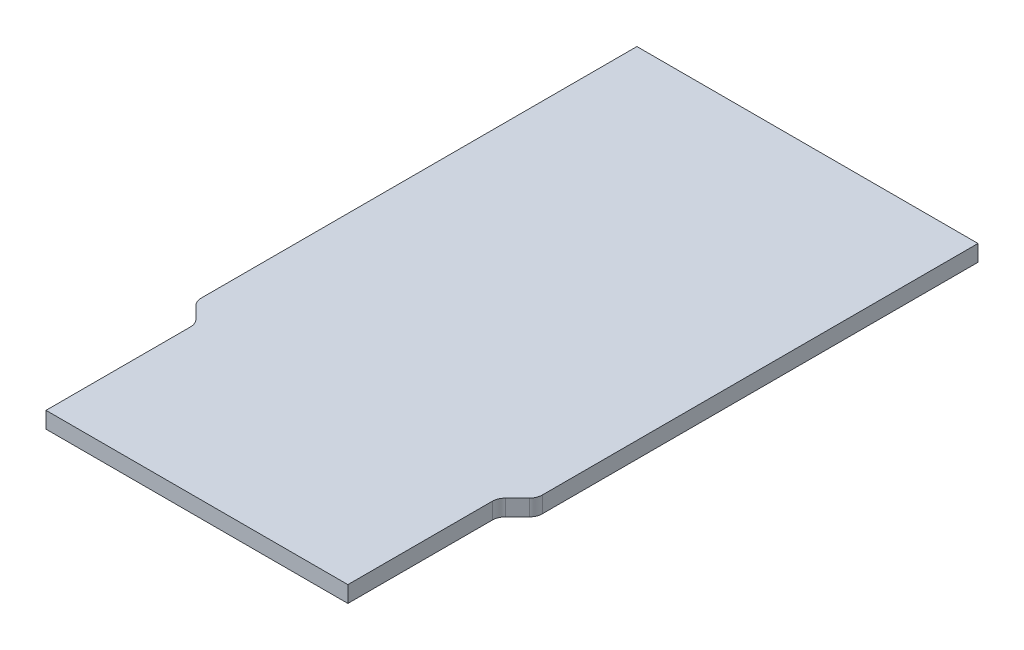
ISO-10303-21;
HEADER;
FILE_DESCRIPTION(('STEP AP214'),'2;1');
FILE_NAME('part.step','',(''),(''),'','','');
FILE_SCHEMA(('AUTOMOTIVE_DESIGN { 1 0 10303 214 1 1 1 1 }'));
ENDSEC;
DATA;
#1=APPLICATION_CONTEXT('core data for automotive mechanical design processes');
#2=APPLICATION_PROTOCOL_DEFINITION('international standard','automotive_design',2000,#1);
#3=PRODUCT_CONTEXT('',#1,'mechanical');
#4=PRODUCT('Part','Part','',(#3));
#5=PRODUCT_RELATED_PRODUCT_CATEGORY('part','',(#4));
#6=PRODUCT_DEFINITION_FORMATION('','',#4);
#7=PRODUCT_DEFINITION_CONTEXT('part definition',#1,'design');
#8=PRODUCT_DEFINITION('design','',#6,#7);
#9=PRODUCT_DEFINITION_SHAPE('','',#8);
#10=(LENGTH_UNIT() NAMED_UNIT(*) SI_UNIT(.MILLI.,.METRE.));
#11=(NAMED_UNIT(*) PLANE_ANGLE_UNIT() SI_UNIT($,.RADIAN.));
#12=(NAMED_UNIT(*) SI_UNIT($,.STERADIAN.) SOLID_ANGLE_UNIT());
#13=UNCERTAINTY_MEASURE_WITH_UNIT(LENGTH_MEASURE(1.E-05),#10,'distance_accuracy_value','');
#14=(GEOMETRIC_REPRESENTATION_CONTEXT(3) GLOBAL_UNCERTAINTY_ASSIGNED_CONTEXT((#13)) GLOBAL_UNIT_ASSIGNED_CONTEXT((#10,
#11,#12)) REPRESENTATION_CONTEXT('',''));
#15=CARTESIAN_POINT('',(0.,0.,0.));
#16=DIRECTION('',(0.,0.,1.));
#17=DIRECTION('',(1.,0.,0.));
#18=AXIS2_PLACEMENT_3D('',#15,#16,#17);
#19=CARTESIAN_POINT('',(-13.3427521616477,7.36119552615719,48.2385191324047));
#20=DIRECTION('',(0.,0.,1.));
#21=DIRECTION('',(1.,0.,0.));
#22=AXIS2_PLACEMENT_3D('',#19,#20,#21);
#23=PLANE('',#22);
#24=DIRECTION('',(1.,0.,0.));
#25=VECTOR('',#24,1.);
#26=CARTESIAN_POINT('',(-13.3427521616477,7.36119552615719,48.2385191324047));
#27=LINE('',#26,#25);
#28=CARTESIAN_POINT('',(-34.9427521616477,7.36119552615719,48.2385191324047));
#29=VERTEX_POINT('',#28);
#30=CARTESIAN_POINT('',(11.2572478383523,7.36119552615719,48.2385191324047));
#31=VERTEX_POINT('',#30);
#32=EDGE_CURVE('E208',#29,#31,#27,.T.);
#33=ORIENTED_EDGE('',*,*,#32,.T.);
#34=DIRECTION('',(0.,-1.,0.));
#35=VECTOR('',#34,1.);
#36=CARTESIAN_POINT('',(11.2572478383523,106.874534692367,48.2385191324047));
#37=LINE('',#36,#35);
#38=CARTESIAN_POINT('',(11.2572478383523,9.86119552615719,48.2385191324047));
#39=VERTEX_POINT('',#38);
#40=EDGE_CURVE('E143',#39,#31,#37,.T.);
#41=ORIENTED_EDGE('',*,*,#40,.F.);
#42=DIRECTION('',(1.,0.,0.));
#43=VECTOR('',#42,1.);
#44=CARTESIAN_POINT('',(-37.9427521616477,9.86119552615719,48.2385191324047));
#45=LINE('',#44,#43);
#46=CARTESIAN_POINT('',(-34.9427521616477,9.86119552615719,48.2385191324047));
#47=VERTEX_POINT('',#46);
#48=EDGE_CURVE('E52',#39,#47,#45,.F.);
#49=ORIENTED_EDGE('',*,*,#48,.T.);
#50=DIRECTION('',(0.,1.,0.));
#51=VECTOR('',#50,1.);
#52=CARTESIAN_POINT('',(-34.9427521616477,7.36119552615719,48.2385191324047));
#53=LINE('',#52,#51);
#54=EDGE_CURVE('E78',#29,#47,#53,.T.);
#55=ORIENTED_EDGE('',*,*,#54,.F.);
#56=EDGE_LOOP('',(#33,#41,#49,#55));
#57=FACE_BOUND('',#56,.T.);
#58=ADVANCED_FACE('F35',(#57),#23,.T.);
#59=CARTESIAN_POINT('',(-13.3427521616477,7.36119552615719,15.802027459301));
#60=DIRECTION('',(0.,1.,0.));
#61=DIRECTION('',(0.,0.,1.));
#62=AXIS2_PLACEMENT_3D('',#59,#60,#61);
#63=PLANE('',#62);
#64=DIRECTION('',(0.,0.,1.));
#65=VECTOR('',#64,1.);
#66=CARTESIAN_POINT('',(-37.9427521616477,7.36119552615719,15.802027459301));
#67=LINE('',#66,#65);
#68=CARTESIAN_POINT('',(-37.9427521616477,7.36119552615719,-45.197972540699));
#69=VERTEX_POINT('',#68);
#70=CARTESIAN_POINT('',(-37.9427521616477,7.36119552615719,21.473600334555));
#71=VERTEX_POINT('',#70);
#72=EDGE_CURVE('E194',#69,#71,#67,.T.);
#73=ORIENTED_EDGE('',*,*,#72,.F.);
#74=DIRECTION('',(-1.,0.,0.));
#75=VECTOR('',#74,1.);
#76=CARTESIAN_POINT('',(-13.3427521616477,7.36119552615719,-45.197972540699));
#77=LINE('',#76,#75);
#78=CARTESIAN_POINT('',(14.2572478383523,7.36119552615719,-45.197972540699));
#79=VERTEX_POINT('',#78);
#80=EDGE_CURVE('E169',#79,#69,#77,.T.);
#81=ORIENTED_EDGE('',*,*,#80,.F.);
#82=DIRECTION('',(0.,0.,1.));
#83=VECTOR('',#82,1.);
#84=CARTESIAN_POINT('',(14.2572478383523,7.36119552615719,-43.1979725406991));
#85=LINE('',#84,#83);
#86=CARTESIAN_POINT('',(14.2572478383523,7.36119552615719,21.473600334555));
#87=VERTEX_POINT('',#86);
#88=EDGE_CURVE('E158',#79,#87,#85,.T.);
#89=ORIENTED_EDGE('',*,*,#88,.T.);
#90=CARTESIAN_POINT('',(12.2572478383523,7.36119552615719,21.473600334555));
#91=DIRECTION('',(0.,-1.,0.));
#92=DIRECTION('',(1.,0.,0.));
#93=AXIS2_PLACEMENT_3D('',#90,#91,#92);
#94=CIRCLE('',#93,1.99999999999944);
#95=CARTESIAN_POINT('',(13.6714614007235,7.36119552615719,22.8878138969291));
#96=VERTEX_POINT('',#95);
#97=EDGE_CURVE('E171',#87,#96,#94,.T.);
#98=ORIENTED_EDGE('',*,*,#97,.T.);
#99=DIRECTION('',(-0.707106781185696,0.,0.707106781187399));
#100=VECTOR('',#99,1.);
#101=CARTESIAN_POINT('',(13.6714614007231,7.36119552615719,22.8878138969288));
#102=LINE('',#101,#100);
#103=CARTESIAN_POINT('',(11.8430342759823,7.36119552615719,24.716241021674));
#104=VERTEX_POINT('',#103);
#105=EDGE_CURVE('E174',#96,#104,#102,.T.);
#106=ORIENTED_EDGE('',*,*,#105,.T.);
#107=CARTESIAN_POINT('',(13.2572478383523,7.36119552615719,26.130454584051));
#108=DIRECTION('',(0.,1.,0.));
#109=DIRECTION('',(1.,0.,0.));
#110=AXIS2_PLACEMENT_3D('',#107,#108,#109);
#111=CIRCLE('',#110,2.00000000000043);
#112=CARTESIAN_POINT('',(11.2572478383519,7.36119552615719,26.130454584051));
#113=VERTEX_POINT('',#112);
#114=EDGE_CURVE('E177',#104,#113,#111,.T.);
#115=ORIENTED_EDGE('',*,*,#114,.T.);
#116=DIRECTION('',(0.,0.,1.));
#117=VECTOR('',#116,1.);
#118=CARTESIAN_POINT('',(11.257247838352,7.36119552615719,26.130454584051));
#119=LINE('',#118,#117);
#120=EDGE_CURVE('E180',#113,#31,#119,.T.);
#121=ORIENTED_EDGE('',*,*,#120,.T.);
#122=ORIENTED_EDGE('',*,*,#32,.F.);
#123=DIRECTION('',(0.,0.,1.));
#124=VECTOR('',#123,1.);
#125=CARTESIAN_POINT('',(-34.9427521616473,7.36119552615719,15.8020274593007));
#126=LINE('',#125,#124);
#127=CARTESIAN_POINT('',(-34.9427521616474,7.36119552615719,26.130454584051));
#128=VERTEX_POINT('',#127);
#129=EDGE_CURVE('E206',#128,#29,#126,.T.);
#130=ORIENTED_EDGE('',*,*,#129,.F.);
#131=CARTESIAN_POINT('',(-36.9427521616477,7.36119552615719,26.130454584051));
#132=DIRECTION('',(0.,1.,0.));
#133=DIRECTION('',(0.,0.,1.));
#134=AXIS2_PLACEMENT_3D('',#131,#132,#133);
#135=CIRCLE('',#134,2.00000000000043);
#136=CARTESIAN_POINT('',(-35.5285385992777,7.36119552615719,24.716241021674));
#137=VERTEX_POINT('',#136);
#138=EDGE_CURVE('E203',#128,#137,#135,.T.);
#139=ORIENTED_EDGE('',*,*,#138,.T.);
#140=DIRECTION('',(0.707106781185696,0.,0.707106781187399));
#141=VECTOR('',#140,1.);
#142=CARTESIAN_POINT('',(-28.8927521616759,7.36119552615719,31.3520274592917));
#143=LINE('',#142,#141);
#144=CARTESIAN_POINT('',(-37.3569657240185,7.36119552615719,22.8878138969288));
#145=VERTEX_POINT('',#144);
#146=EDGE_CURVE('E200',#145,#137,#143,.T.);
#147=ORIENTED_EDGE('',*,*,#146,.F.);
#148=CARTESIAN_POINT('',(-35.9427521616477,7.36119552615719,21.473600334555));
#149=DIRECTION('',(0.,1.,0.));
#150=DIRECTION('',(0.,0.,1.));
#151=AXIS2_PLACEMENT_3D('',#148,#149,#150);
#152=CIRCLE('',#151,1.99999999999943);
#153=EDGE_CURVE('E197',#71,#145,#152,.T.);
#154=ORIENTED_EDGE('',*,*,#153,.F.);
#155=EDGE_LOOP('',(#73,#81,#89,#98,#106,#115,#121,#122,#130,#139,#147,#154));
#156=FACE_BOUND('',#155,.T.);
#157=ADVANCED_FACE('F229',(#156),#63,.F.);
#158=CARTESIAN_POINT('',(-34.9427521616477,43.7450790026372,47.185910935781));
#159=DIRECTION('',(1.,0.,0.));
#160=DIRECTION('',(0.,0.,-1.));
#161=AXIS2_PLACEMENT_3D('',#158,#159,#160);
#162=PLANE('',#161);
#163=ORIENTED_EDGE('',*,*,#54,.T.);
#164=DIRECTION('',(0.,0.,-1.));
#165=VECTOR('',#164,1.);
#166=CARTESIAN_POINT('',(-34.9427521616477,9.86119552615719,46.302027459301));
#167=LINE('',#166,#165);
#168=CARTESIAN_POINT('',(-34.9427521616477,9.86119552615719,26.130454584051));
#169=VERTEX_POINT('',#168);
#170=EDGE_CURVE('E74',#47,#169,#167,.T.);
#171=ORIENTED_EDGE('',*,*,#170,.T.);
#172=DIRECTION('',(0.,-1.,0.));
#173=VECTOR('',#172,1.);
#174=CARTESIAN_POINT('',(-34.9427521616477,9.86119552615719,26.130454584051));
#175=LINE('',#174,#173);
#176=EDGE_CURVE('E39',#169,#128,#175,.T.);
#177=ORIENTED_EDGE('',*,*,#176,.T.);
#178=ORIENTED_EDGE('',*,*,#129,.T.);
#179=EDGE_LOOP('',(#163,#171,#177,#178));
#180=FACE_BOUND('',#179,.T.);
#181=ADVANCED_FACE('F236',(#180),#162,.F.);
#182=CARTESIAN_POINT('',(-37.9427521616477,9.86119552615719,-45.197972540699));
#183=DIRECTION('',(0.,1.,0.));
#184=DIRECTION('',(0.,0.,-1.));
#185=AXIS2_PLACEMENT_3D('',#182,#183,#184);
#186=PLANE('',#185);
#187=DIRECTION('',(0.,0.,-1.));
#188=VECTOR('',#187,1.);
#189=CARTESIAN_POINT('',(14.2572478383523,9.86119552615719,-43.1979725406991));
#190=LINE('',#189,#188);
#191=CARTESIAN_POINT('',(14.2572478383523,9.86119552615719,21.473600334555));
#192=VERTEX_POINT('',#191);
#193=CARTESIAN_POINT('',(14.2572478383523,9.86119552615719,-45.197972540699));
#194=VERTEX_POINT('',#193);
#195=EDGE_CURVE('E133',#192,#194,#190,.T.);
#196=ORIENTED_EDGE('',*,*,#195,.T.);
#197=DIRECTION('',(1.,0.,0.));
#198=VECTOR('',#197,1.);
#199=CARTESIAN_POINT('',(-35.9427521616477,9.86119552615719,-45.197972540699));
#200=LINE('',#199,#198);
#201=CARTESIAN_POINT('',(-37.9427521616477,9.86119552615719,-45.197972540699));
#202=VERTEX_POINT('',#201);
#203=EDGE_CURVE('E136',#202,#194,#200,.T.);
#204=ORIENTED_EDGE('',*,*,#203,.F.);
#205=DIRECTION('',(0.,0.,1.));
#206=VECTOR('',#205,1.);
#207=CARTESIAN_POINT('',(-37.9427521616477,9.86119552615719,-43.197972540699));
#208=LINE('',#207,#206);
#209=CARTESIAN_POINT('',(-37.9427521616477,9.86119552615719,21.473600334555));
#210=VERTEX_POINT('',#209);
#211=EDGE_CURVE('E11',#202,#210,#208,.T.);
#212=ORIENTED_EDGE('',*,*,#211,.T.);
#213=CARTESIAN_POINT('',(-35.9427521616477,9.86119552615719,21.473600334555));
#214=DIRECTION('',(0.,1.,0.));
#215=DIRECTION('',(-1.,0.,0.));
#216=AXIS2_PLACEMENT_3D('',#213,#214,#215);
#217=CIRCLE('',#216,2.);
#218=CARTESIAN_POINT('',(-37.3569657240177,9.86119552615719,22.887813896928));
#219=VERTEX_POINT('',#218);
#220=EDGE_CURVE('E44',#210,#219,#217,.T.);
#221=ORIENTED_EDGE('',*,*,#220,.T.);
#222=DIRECTION('',(-0.707106781186548,0.,-0.707106781186548));
#223=VECTOR('',#222,1.);
#224=CARTESIAN_POINT('',(-35.5285385992777,9.86119552615719,24.716241021674));
#225=LINE('',#224,#223);
#226=CARTESIAN_POINT('',(-35.5285385992777,9.86119552615719,24.716241021674));
#227=VERTEX_POINT('',#226);
#228=EDGE_CURVE('E213',#227,#219,#225,.T.);
#229=ORIENTED_EDGE('',*,*,#228,.F.);
#230=CARTESIAN_POINT('',(-36.9427521616477,9.86119552615719,26.130454584051));
#231=DIRECTION('',(0.,-1.,0.));
#232=DIRECTION('',(0.707106781186548,0.,-0.707106781186548));
#233=AXIS2_PLACEMENT_3D('',#230,#231,#232);
#234=CIRCLE('',#233,2.);
#235=EDGE_CURVE('E152',#227,#169,#234,.T.);
#236=ORIENTED_EDGE('',*,*,#235,.T.);
#237=ORIENTED_EDGE('',*,*,#170,.F.);
#238=ORIENTED_EDGE('',*,*,#48,.F.);
#239=DIRECTION('',(0.,0.,-1.));
#240=VECTOR('',#239,1.);
#241=CARTESIAN_POINT('',(11.257247838352,9.86119552615719,26.130454584051));
#242=LINE('',#241,#240);
#243=CARTESIAN_POINT('',(11.2572478383519,9.86119552615719,26.130454584051));
#244=VERTEX_POINT('',#243);
#245=EDGE_CURVE('E167',#39,#244,#242,.T.);
#246=ORIENTED_EDGE('',*,*,#245,.T.);
#247=CARTESIAN_POINT('',(13.2572478383523,9.86119552615719,26.130454584051));
#248=DIRECTION('',(0.,-1.,0.));
#249=DIRECTION('',(1.,0.,0.));
#250=AXIS2_PLACEMENT_3D('',#247,#248,#249);
#251=CIRCLE('',#250,2.00000000000043);
#252=CARTESIAN_POINT('',(11.8430342759823,9.86119552615719,24.716241021674));
#253=VERTEX_POINT('',#252);
#254=EDGE_CURVE('E165',#244,#253,#251,.T.);
#255=ORIENTED_EDGE('',*,*,#254,.T.);
#256=DIRECTION('',(0.707106781185696,0.,-0.707106781187399));
#257=VECTOR('',#256,1.);
#258=CARTESIAN_POINT('',(13.6714614007231,9.86119552615719,22.8878138969288));
#259=LINE('',#258,#257);
#260=CARTESIAN_POINT('',(13.6714614007235,9.86119552615719,22.8878138969291));
#261=VERTEX_POINT('',#260);
#262=EDGE_CURVE('E163',#253,#261,#259,.T.);
#263=ORIENTED_EDGE('',*,*,#262,.T.);
#264=CARTESIAN_POINT('',(12.2572478383523,9.86119552615719,21.473600334555));
#265=DIRECTION('',(0.,-1.,0.));
#266=DIRECTION('',(1.,0.,0.));
#267=AXIS2_PLACEMENT_3D('',#264,#265,#266);
#268=CIRCLE('',#267,1.99999999999944);
#269=EDGE_CURVE('E139',#261,#192,#268,.F.);
#270=ORIENTED_EDGE('',*,*,#269,.T.);
#271=EDGE_LOOP('',(#196,#204,#212,#221,#229,#236,#237,#238,#246,#255,#263,#270));
#272=FACE_BOUND('',#271,.T.);
#273=ADVANCED_FACE('F135',(#272),#186,.T.);
#274=CARTESIAN_POINT('',(-13.3427521616477,9.11119552615719,-45.197972540699));
#275=DIRECTION('',(0.,0.,1.));
#276=DIRECTION('',(-1.,0.,0.));
#277=AXIS2_PLACEMENT_3D('',#274,#275,#276);
#278=PLANE('',#277);
#279=ORIENTED_EDGE('',*,*,#203,.T.);
#280=DIRECTION('',(0.,1.,0.));
#281=VECTOR('',#280,1.);
#282=CARTESIAN_POINT('',(14.2572478383523,-44.8771045993254,-45.197972540699));
#283=LINE('',#282,#281);
#284=EDGE_CURVE('E149',#79,#194,#283,.T.);
#285=ORIENTED_EDGE('',*,*,#284,.F.);
#286=ORIENTED_EDGE('',*,*,#80,.T.);
#287=DIRECTION('',(0.,1.,0.));
#288=VECTOR('',#287,1.);
#289=CARTESIAN_POINT('',(-37.9427521616477,-44.8771045993254,-45.197972540699));
#290=LINE('',#289,#288);
#291=EDGE_CURVE('E151',#69,#202,#290,.T.);
#292=ORIENTED_EDGE('',*,*,#291,.T.);
#293=EDGE_LOOP('',(#279,#285,#286,#292));
#294=FACE_BOUND('',#293,.T.);
#295=ADVANCED_FACE('F148',(#294),#278,.F.);
#296=CARTESIAN_POINT('',(-37.9427521616477,9.11119552615719,0.552027459300955));
#297=DIRECTION('',(-1.,0.,0.));
#298=DIRECTION('',(0.,0.,-1.));
#299=AXIS2_PLACEMENT_3D('',#296,#297,#298);
#300=PLANE('',#299);
#301=ORIENTED_EDGE('',*,*,#211,.F.);
#302=ORIENTED_EDGE('',*,*,#291,.F.);
#303=ORIENTED_EDGE('',*,*,#72,.T.);
#304=DIRECTION('',(0.,1.,0.));
#305=VECTOR('',#304,1.);
#306=CARTESIAN_POINT('',(-37.9427521616477,8.36119552615719,21.473600334555));
#307=LINE('',#306,#305);
#308=EDGE_CURVE('E153',#71,#210,#307,.T.);
#309=ORIENTED_EDGE('',*,*,#308,.T.);
#310=EDGE_LOOP('',(#301,#302,#303,#309));
#311=FACE_BOUND('',#310,.T.);
#312=ADVANCED_FACE('F234',(#311),#300,.T.);
#313=CARTESIAN_POINT('',(-35.9427521616477,-39.2202044738428,21.473600334555));
#314=DIRECTION('',(0.,1.,0.));
#315=DIRECTION('',(1.,0.,0.));
#316=AXIS2_PLACEMENT_3D('',#313,#314,#315);
#317=CYLINDRICAL_SURFACE('',#316,2.);
#318=ORIENTED_EDGE('',*,*,#308,.F.);
#319=ORIENTED_EDGE('',*,*,#153,.T.);
#320=DIRECTION('',(0.,1.,0.));
#321=VECTOR('',#320,1.);
#322=CARTESIAN_POINT('',(-37.3569657240177,8.36119552615719,22.887813896928));
#323=LINE('',#322,#321);
#324=EDGE_CURVE('E215',#145,#219,#323,.T.);
#325=ORIENTED_EDGE('',*,*,#324,.T.);
#326=ORIENTED_EDGE('',*,*,#220,.F.);
#327=EDGE_LOOP('',(#318,#319,#325,#326));
#328=FACE_BOUND('',#327,.T.);
#329=ADVANCED_FACE('F232',(#328),#317,.T.);
#330=CARTESIAN_POINT('',(-36.4427521616477,9.11119552615719,23.802027459301));
#331=DIRECTION('',(0.707106781186548,0.,-0.707106781186548));
#332=DIRECTION('',(0.707106781186548,0.,0.707106781186548));
#333=AXIS2_PLACEMENT_3D('',#330,#331,#332);
#334=PLANE('',#333);
#335=ORIENTED_EDGE('',*,*,#324,.F.);
#336=ORIENTED_EDGE('',*,*,#146,.T.);
#337=DIRECTION('',(0.,-1.,0.));
#338=VECTOR('',#337,1.);
#339=CARTESIAN_POINT('',(-35.5285385992777,9.86119552615719,24.716241021674));
#340=LINE('',#339,#338);
#341=EDGE_CURVE('E216',#227,#137,#340,.T.);
#342=ORIENTED_EDGE('',*,*,#341,.F.);
#343=ORIENTED_EDGE('',*,*,#228,.T.);
#344=EDGE_LOOP('',(#335,#336,#342,#343));
#345=FACE_BOUND('',#344,.T.);
#346=ADVANCED_FACE('F231',(#345),#334,.F.);
#347=CARTESIAN_POINT('',(-36.9427521616477,92.4425955261572,26.130454584051));
#348=DIRECTION('',(0.,-1.,0.));
#349=DIRECTION('',(-0.707106781186547,0.,0.707106781186548));
#350=AXIS2_PLACEMENT_3D('',#347,#348,#349);
#351=CYLINDRICAL_SURFACE('',#350,2.);
#352=ORIENTED_EDGE('',*,*,#341,.T.);
#353=ORIENTED_EDGE('',*,*,#138,.F.);
#354=ORIENTED_EDGE('',*,*,#176,.F.);
#355=ORIENTED_EDGE('',*,*,#235,.F.);
#356=EDGE_LOOP('',(#352,#353,#354,#355));
#357=FACE_BOUND('',#356,.T.);
#358=ADVANCED_FACE('F37',(#357),#351,.F.);
#359=CARTESIAN_POINT('',(11.257247838352,106.874534692367,26.130454584051));
#360=DIRECTION('',(1.,0.,0.));
#361=DIRECTION('',(0.,0.,-1.));
#362=AXIS2_PLACEMENT_3D('',#359,#360,#361);
#363=PLANE('',#362);
#364=ORIENTED_EDGE('',*,*,#245,.F.);
#365=ORIENTED_EDGE('',*,*,#40,.T.);
#366=ORIENTED_EDGE('',*,*,#120,.F.);
#367=DIRECTION('',(0.,-1.,0.));
#368=VECTOR('',#367,1.);
#369=CARTESIAN_POINT('',(11.2572478383519,106.874534692367,26.130454584051));
#370=LINE('',#369,#368);
#371=EDGE_CURVE('E186',#244,#113,#370,.T.);
#372=ORIENTED_EDGE('',*,*,#371,.F.);
#373=EDGE_LOOP('',(#364,#365,#366,#372));
#374=FACE_BOUND('',#373,.T.);
#375=ADVANCED_FACE('F264',(#374),#363,.T.);
#376=CARTESIAN_POINT('',(13.2572478383523,106.874534692367,26.130454584051));
#377=DIRECTION('',(0.,-1.,0.));
#378=DIRECTION('',(1.,0.,0.));
#379=AXIS2_PLACEMENT_3D('',#376,#377,#378);
#380=CYLINDRICAL_SURFACE('',#379,2.00000000000043);
#381=ORIENTED_EDGE('',*,*,#254,.F.);
#382=ORIENTED_EDGE('',*,*,#371,.T.);
#383=ORIENTED_EDGE('',*,*,#114,.F.);
#384=DIRECTION('',(0.,-1.,0.));
#385=VECTOR('',#384,1.);
#386=CARTESIAN_POINT('',(11.8430342759823,106.874534692367,24.716241021674));
#387=LINE('',#386,#385);
#388=EDGE_CURVE('E188',#253,#104,#387,.T.);
#389=ORIENTED_EDGE('',*,*,#388,.F.);
#390=EDGE_LOOP('',(#381,#382,#383,#389));
#391=FACE_BOUND('',#390,.T.);
#392=ADVANCED_FACE('F260',(#391),#380,.F.);
#393=CARTESIAN_POINT('',(13.6714614007231,106.874534692367,22.8878138969288));
#394=DIRECTION('',(0.707106781187399,0.,0.707106781185696));
#395=DIRECTION('',(0.707106781185696,0.,-0.707106781187399));
#396=AXIS2_PLACEMENT_3D('',#393,#394,#395);
#397=PLANE('',#396);
#398=ORIENTED_EDGE('',*,*,#262,.F.);
#399=ORIENTED_EDGE('',*,*,#388,.T.);
#400=ORIENTED_EDGE('',*,*,#105,.F.);
#401=DIRECTION('',(0.,-1.,0.));
#402=VECTOR('',#401,1.);
#403=CARTESIAN_POINT('',(13.6714614007235,106.874534692367,22.8878138969292));
#404=LINE('',#403,#402);
#405=EDGE_CURVE('E190',#261,#96,#404,.T.);
#406=ORIENTED_EDGE('',*,*,#405,.F.);
#407=EDGE_LOOP('',(#398,#399,#400,#406));
#408=FACE_BOUND('',#407,.T.);
#409=ADVANCED_FACE('F256',(#408),#397,.T.);
#410=CARTESIAN_POINT('',(12.2572478383523,106.874534692367,21.473600334555));
#411=DIRECTION('',(0.,-1.,0.));
#412=DIRECTION('',(1.,0.,0.));
#413=AXIS2_PLACEMENT_3D('',#410,#411,#412);
#414=CYLINDRICAL_SURFACE('',#413,1.99999999999944);
#415=ORIENTED_EDGE('',*,*,#269,.F.);
#416=ORIENTED_EDGE('',*,*,#405,.T.);
#417=ORIENTED_EDGE('',*,*,#97,.F.);
#418=DIRECTION('',(0.,-1.,0.));
#419=VECTOR('',#418,1.);
#420=CARTESIAN_POINT('',(14.2572478383523,106.874534692367,21.473600334555));
#421=LINE('',#420,#419);
#422=EDGE_CURVE('E183',#192,#87,#421,.T.);
#423=ORIENTED_EDGE('',*,*,#422,.F.);
#424=EDGE_LOOP('',(#415,#416,#417,#423));
#425=FACE_BOUND('',#424,.T.);
#426=ADVANCED_FACE('F253',(#425),#414,.T.);
#427=CARTESIAN_POINT('',(14.2572478383523,106.874534692367,-43.197972540699));
#428=DIRECTION('',(1.,0.,0.));
#429=DIRECTION('',(0.,1.,0.));
#430=AXIS2_PLACEMENT_3D('',#427,#428,#429);
#431=PLANE('',#430);
#432=ORIENTED_EDGE('',*,*,#195,.F.);
#433=ORIENTED_EDGE('',*,*,#422,.T.);
#434=ORIENTED_EDGE('',*,*,#88,.F.);
#435=ORIENTED_EDGE('',*,*,#284,.T.);
#436=EDGE_LOOP('',(#432,#433,#434,#435));
#437=FACE_BOUND('',#436,.T.);
#438=ADVANCED_FACE('F156',(#437),#431,.T.);
#439=CLOSED_SHELL('',(#58,#157,#181,#273,#295,#312,#329,#346,#358,#375,#392,#409,#426,#438));
#440=MANIFOLD_SOLID_BREP('B2',#439);
#441=ADVANCED_BREP_SHAPE_REPRESENTATION('',(#18,#440),#14);
#442=SHAPE_DEFINITION_REPRESENTATION(#9,#441);
ENDSEC;
END-ISO-10303-21;
